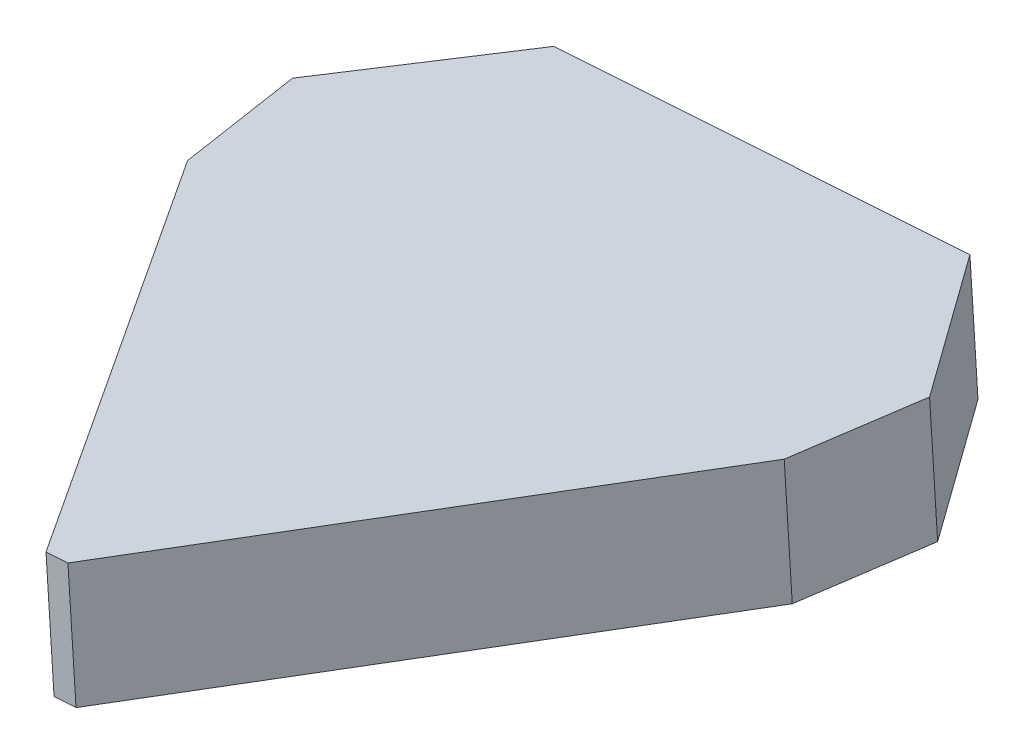
ISO-10303-21;
HEADER;
FILE_DESCRIPTION(('STEP AP214'),'2;1');
FILE_NAME('part.step','',(''),(''),'','','');
FILE_SCHEMA(('AUTOMOTIVE_DESIGN { 1 0 10303 214 1 1 1 1 }'));
ENDSEC;
DATA;
#1=APPLICATION_CONTEXT('core data for automotive mechanical design processes');
#2=APPLICATION_PROTOCOL_DEFINITION('international standard','automotive_design',2000,#1);
#3=PRODUCT_CONTEXT('',#1,'mechanical');
#4=PRODUCT('Part','Part','',(#3));
#5=PRODUCT_RELATED_PRODUCT_CATEGORY('part','',(#4));
#6=PRODUCT_DEFINITION_FORMATION('','',#4);
#7=PRODUCT_DEFINITION_CONTEXT('part definition',#1,'design');
#8=PRODUCT_DEFINITION('design','',#6,#7);
#9=PRODUCT_DEFINITION_SHAPE('','',#8);
#10=(LENGTH_UNIT() NAMED_UNIT(*) SI_UNIT(.MILLI.,.METRE.));
#11=(NAMED_UNIT(*) PLANE_ANGLE_UNIT() SI_UNIT($,.RADIAN.));
#12=(NAMED_UNIT(*) SI_UNIT($,.STERADIAN.) SOLID_ANGLE_UNIT());
#13=UNCERTAINTY_MEASURE_WITH_UNIT(LENGTH_MEASURE(1.E-05),#10,'distance_accuracy_value','');
#14=(GEOMETRIC_REPRESENTATION_CONTEXT(3) GLOBAL_UNCERTAINTY_ASSIGNED_CONTEXT((#13)) GLOBAL_UNIT_ASSIGNED_CONTEXT((#10,
#11,#12)) REPRESENTATION_CONTEXT('',''));
#15=CARTESIAN_POINT('',(0.,0.,0.));
#16=DIRECTION('',(0.,0.,1.));
#17=DIRECTION('',(1.,0.,0.));
#18=AXIS2_PLACEMENT_3D('',#15,#16,#17);
#19=CARTESIAN_POINT('',(66.04736781898,-49.9462567132194,133.429444574754));
#20=DIRECTION('',(0.,0.,1.));
#21=DIRECTION('',(1.,0.,0.));
#22=AXIS2_PLACEMENT_3D('',#19,#20,#21);
#23=PLANE('',#22);
#24=DIRECTION('',(-0.99779024737169,-0.0664426237436659,0.));
#25=VECTOR('',#24,1.);
#26=CARTESIAN_POINT('',(67.5755481650843,-72.8954324027683,133.429444574754));
#27=LINE('',#26,#25);
#28=CARTESIAN_POINT('',(67.5755481650843,-72.8954324027683,133.429444574754));
#29=VERTEX_POINT('',#28);
#30=CARTESIAN_POINT('',(63.4252354433026,-73.1718007750973,133.429444574754));
#31=VERTEX_POINT('',#30);
#32=EDGE_CURVE('E132',#29,#31,#27,.T.);
#33=ORIENTED_EDGE('',*,*,#32,.F.);
#34=DIRECTION('',(0.0664426237436648,-0.99779024737169,0.));
#35=VECTOR('',#34,1.);
#36=CARTESIAN_POINT('',(66.04736781898,-49.9462567132194,133.429444574754));
#37=LINE('',#36,#35);
#38=CARTESIAN_POINT('',(66.04736781898,-49.9462567132194,133.429444574754));
#39=VERTEX_POINT('',#38);
#40=EDGE_CURVE('E11',#39,#29,#37,.T.);
#41=ORIENTED_EDGE('',*,*,#40,.F.);
#42=DIRECTION('',(-0.99779024737169,-0.0664426237436659,0.));
#43=VECTOR('',#42,1.);
#44=CARTESIAN_POINT('',(66.04736781898,-49.9462567132194,133.429444574754));
#45=LINE('',#44,#43);
#46=CARTESIAN_POINT('',(61.8970550971983,-50.2226250855484,133.429444574754));
#47=VERTEX_POINT('',#46);
#48=EDGE_CURVE('E152',#39,#47,#45,.T.);
#49=ORIENTED_EDGE('',*,*,#48,.T.);
#50=DIRECTION('',(0.0664426237436648,-0.99779024737169,0.));
#51=VECTOR('',#50,1.);
#52=CARTESIAN_POINT('',(61.8970550971983,-50.2226250855484,133.429444574754));
#53=LINE('',#52,#51);
#54=EDGE_CURVE('E38',#47,#31,#53,.T.);
#55=ORIENTED_EDGE('',*,*,#54,.T.);
#56=EDGE_LOOP('',(#33,#41,#49,#55));
#57=FACE_BOUND('',#56,.T.);
#58=ADVANCED_FACE('F35',(#57),#23,.T.);
#59=CARTESIAN_POINT('',(120.442328114417,-46.3241087818466,52.2349737519865));
#60=DIRECTION('',(0.828390615980457,0.0551623411386873,0.557428115074597));
#61=DIRECTION('',(0.558278149998216,0.,-0.829653847839308));
#62=AXIS2_PLACEMENT_3D('',#59,#60,#61);
#63=PLANE('',#62);
#64=DIRECTION('',(-0.556196336832217,-0.0370369865140417,0.830225208316624));
#65=VECTOR('',#64,1.);
#66=CARTESIAN_POINT('',(121.970508460521,-69.2732844713955,52.2349737519865));
#67=LINE('',#66,#65);
#68=CARTESIAN_POINT('',(121.970508460521,-69.2732844713955,52.2349737519865));
#69=VERTEX_POINT('',#68);
#70=EDGE_CURVE('E150',#69,#29,#67,.T.);
#71=ORIENTED_EDGE('',*,*,#70,.F.);
#72=DIRECTION('',(0.0664426237436648,-0.99779024737169,0.));
#73=VECTOR('',#72,1.);
#74=CARTESIAN_POINT('',(120.442328114417,-46.3241087818466,52.2349737519865));
#75=LINE('',#74,#73);
#76=CARTESIAN_POINT('',(120.442328114417,-46.3241087818466,52.2349737519865));
#77=VERTEX_POINT('',#76);
#78=EDGE_CURVE('E44',#77,#69,#75,.T.);
#79=ORIENTED_EDGE('',*,*,#78,.F.);
#80=DIRECTION('',(-0.556196336832217,-0.0370369865140417,0.830225208316624));
#81=VECTOR('',#80,1.);
#82=CARTESIAN_POINT('',(120.442328114417,-46.3241087818466,52.2349737519865));
#83=LINE('',#82,#81);
#84=EDGE_CURVE('E122',#77,#39,#83,.T.);
#85=ORIENTED_EDGE('',*,*,#84,.T.);
#86=ORIENTED_EDGE('',*,*,#40,.T.);
#87=EDGE_LOOP('',(#71,#79,#85,#86));
#88=FACE_BOUND('',#87,.T.);
#89=ADVANCED_FACE('F164',(#88),#63,.T.);
#90=CARTESIAN_POINT('',(124.266391420117,-46.0694652833139,28.5429561822932));
#91=DIRECTION('',(0.984986002983277,0.0655899920463093,0.159688843913384));
#92=DIRECTION('',(0.160033450659154,0.,-0.987111591802124));
#93=AXIS2_PLACEMENT_3D('',#90,#91,#92);
#94=PLANE('',#93);
#95=DIRECTION('',(-0.159335971070835,-0.0106101457721976,0.987167398737219));
#96=VECTOR('',#95,1.);
#97=CARTESIAN_POINT('',(125.794571766221,-69.0186409728627,28.5429561822932));
#98=LINE('',#97,#96);
#99=CARTESIAN_POINT('',(125.794571766221,-69.0186409728627,28.5429561822932));
#100=VERTEX_POINT('',#99);
#101=EDGE_CURVE('E109',#100,#69,#98,.T.);
#102=ORIENTED_EDGE('',*,*,#101,.F.);
#103=DIRECTION('',(0.0664426237436648,-0.99779024737169,0.));
#104=VECTOR('',#103,1.);
#105=CARTESIAN_POINT('',(124.266391420117,-46.0694652833139,28.5429561822932));
#106=LINE('',#105,#104);
#107=CARTESIAN_POINT('',(124.266391420117,-46.0694652833139,28.5429561822932));
#108=VERTEX_POINT('',#107);
#109=EDGE_CURVE('E104',#108,#100,#106,.T.);
#110=ORIENTED_EDGE('',*,*,#109,.F.);
#111=DIRECTION('',(-0.159335971070835,-0.0106101457721976,0.987167398737219));
#112=VECTOR('',#111,1.);
#113=CARTESIAN_POINT('',(124.266391420117,-46.0694652833139,28.5429561822932));
#114=LINE('',#113,#112);
#115=EDGE_CURVE('E107',#108,#77,#114,.T.);
#116=ORIENTED_EDGE('',*,*,#115,.T.);
#117=ORIENTED_EDGE('',*,*,#78,.T.);
#118=EDGE_LOOP('',(#102,#110,#116,#117));
#119=FACE_BOUND('',#118,.T.);
#120=ADVANCED_FACE('F106',(#119),#94,.T.);
#121=CARTESIAN_POINT('',(103.364080691311,-47.4613453611013,0.));
#122=DIRECTION('',(0.804393156740389,0.0535643558313625,-0.591677707179849));
#123=DIRECTION('',(-0.592528341211539,0.,-0.805549604221305));
#124=AXIS2_PLACEMENT_3D('',#121,#122,#123);
#125=PLANE('',#124);
#126=DIRECTION('',(0.590370245811295,0.0393126192756651,0.806174603188662));
#127=VECTOR('',#126,1.);
#128=CARTESIAN_POINT('',(104.892261037415,-70.4105210506502,0.));
#129=LINE('',#128,#127);
#130=CARTESIAN_POINT('',(104.892261037415,-70.4105210506502,0.));
#131=VERTEX_POINT('',#130);
#132=EDGE_CURVE('E147',#131,#100,#129,.T.);
#133=ORIENTED_EDGE('',*,*,#132,.F.);
#134=DIRECTION('',(0.0664426237436648,-0.99779024737169,0.));
#135=VECTOR('',#134,1.);
#136=CARTESIAN_POINT('',(103.364080691311,-47.4613453611013,0.));
#137=LINE('',#136,#135);
#138=CARTESIAN_POINT('',(103.364080691311,-47.4613453611013,0.));
#139=VERTEX_POINT('',#138);
#140=EDGE_CURVE('E114',#139,#131,#137,.T.);
#141=ORIENTED_EDGE('',*,*,#140,.F.);
#142=DIRECTION('',(0.590370245811295,0.0393126192756651,0.806174603188662));
#143=VECTOR('',#142,1.);
#144=CARTESIAN_POINT('',(103.364080691311,-47.4613453611013,0.));
#145=LINE('',#144,#143);
#146=EDGE_CURVE('E120',#139,#108,#145,.T.);
#147=ORIENTED_EDGE('',*,*,#146,.T.);
#148=ORIENTED_EDGE('',*,*,#109,.T.);
#149=EDGE_LOOP('',(#133,#141,#147,#148));
#150=FACE_BOUND('',#149,.T.);
#151=ADVANCED_FACE('F124',(#150),#125,.T.);
#152=CARTESIAN_POINT('',(24.5803422248675,-52.7075364376665,0.));
#153=DIRECTION('',(0.,0.,-1.));
#154=DIRECTION('',(0.,1.,0.));
#155=AXIS2_PLACEMENT_3D('',#152,#153,#154);
#156=PLANE('',#155);
#157=DIRECTION('',(0.99779024737169,0.0664426237436648,0.));
#158=VECTOR('',#157,1.);
#159=CARTESIAN_POINT('',(26.1085225709718,-75.6567121272154,0.));
#160=LINE('',#159,#158);
#161=CARTESIAN_POINT('',(26.1085225709718,-75.6567121272154,0.));
#162=VERTEX_POINT('',#161);
#163=EDGE_CURVE('E144',#162,#131,#160,.T.);
#164=ORIENTED_EDGE('',*,*,#163,.F.);
#165=DIRECTION('',(0.0664426237436648,-0.99779024737169,0.));
#166=VECTOR('',#165,1.);
#167=CARTESIAN_POINT('',(24.5803422248675,-52.7075364376665,0.));
#168=LINE('',#167,#166);
#169=CARTESIAN_POINT('',(24.5803422248675,-52.7075364376665,0.));
#170=VERTEX_POINT('',#169);
#171=EDGE_CURVE('E156',#170,#162,#168,.T.);
#172=ORIENTED_EDGE('',*,*,#171,.F.);
#173=DIRECTION('',(0.99779024737169,0.0664426237436648,0.));
#174=VECTOR('',#173,1.);
#175=CARTESIAN_POINT('',(24.5803422248675,-52.7075364376665,0.));
#176=LINE('',#175,#174);
#177=EDGE_CURVE('E125',#170,#139,#176,.T.);
#178=ORIENTED_EDGE('',*,*,#177,.T.);
#179=ORIENTED_EDGE('',*,*,#140,.T.);
#180=EDGE_LOOP('',(#164,#172,#178,#179));
#181=FACE_BOUND('',#180,.T.);
#182=ADVANCED_FACE('F177',(#181),#156,.T.);
#183=CARTESIAN_POINT('',(3.67803149606129,-54.099416515454,28.5429561822932));
#184=DIRECTION('',(-0.804393156740389,-0.0535643558313626,-0.591677707179849));
#185=DIRECTION('',(-0.59252834121154,0.,0.805549604221305));
#186=AXIS2_PLACEMENT_3D('',#183,#184,#185);
#187=PLANE('',#186);
#188=DIRECTION('',(0.590370245811296,0.0393126192756651,-0.806174603188662));
#189=VECTOR('',#188,1.);
#190=CARTESIAN_POINT('',(5.20621184216558,-77.0485922050028,28.5429561822932));
#191=LINE('',#190,#189);
#192=CARTESIAN_POINT('',(5.20621184216558,-77.0485922050028,28.5429561822932));
#193=VERTEX_POINT('',#192);
#194=EDGE_CURVE('E141',#193,#162,#191,.T.);
#195=ORIENTED_EDGE('',*,*,#194,.F.);
#196=DIRECTION('',(0.0664426237436648,-0.99779024737169,0.));
#197=VECTOR('',#196,1.);
#198=CARTESIAN_POINT('',(3.67803149606129,-54.099416515454,28.5429561822932));
#199=LINE('',#198,#197);
#200=CARTESIAN_POINT('',(3.67803149606129,-54.099416515454,28.5429561822932));
#201=VERTEX_POINT('',#200);
#202=EDGE_CURVE('E158',#201,#193,#199,.T.);
#203=ORIENTED_EDGE('',*,*,#202,.F.);
#204=DIRECTION('',(0.590370245811296,0.0393126192756651,-0.806174603188662));
#205=VECTOR('',#204,1.);
#206=CARTESIAN_POINT('',(3.67803149606129,-54.099416515454,28.5429561822932));
#207=LINE('',#206,#205);
#208=EDGE_CURVE('E127',#201,#170,#207,.T.);
#209=ORIENTED_EDGE('',*,*,#208,.T.);
#210=ORIENTED_EDGE('',*,*,#171,.T.);
#211=EDGE_LOOP('',(#195,#203,#209,#210));
#212=FACE_BOUND('',#211,.T.);
#213=ADVANCED_FACE('F180',(#212),#187,.T.);
#214=CARTESIAN_POINT('',(7.50209480176133,-53.8447730169212,52.2349737519865));
#215=DIRECTION('',(-0.984986002983277,-0.0655899920463093,0.159688843913385));
#216=DIRECTION('',(0.160033450659154,0.,0.987111591802124));
#217=AXIS2_PLACEMENT_3D('',#214,#215,#216);
#218=PLANE('',#217);
#219=DIRECTION('',(-0.159335971070835,-0.0106101457721982,-0.987167398737219));
#220=VECTOR('',#219,1.);
#221=CARTESIAN_POINT('',(9.03027514786562,-76.7939487064701,52.2349737519865));
#222=LINE('',#221,#220);
#223=CARTESIAN_POINT('',(9.03027514786562,-76.7939487064701,52.2349737519865));
#224=VERTEX_POINT('',#223);
#225=EDGE_CURVE('E138',#224,#193,#222,.T.);
#226=ORIENTED_EDGE('',*,*,#225,.F.);
#227=DIRECTION('',(0.0664426237436648,-0.99779024737169,0.));
#228=VECTOR('',#227,1.);
#229=CARTESIAN_POINT('',(7.50209480176133,-53.8447730169212,52.2349737519865));
#230=LINE('',#229,#228);
#231=CARTESIAN_POINT('',(7.50209480176133,-53.8447730169212,52.2349737519865));
#232=VERTEX_POINT('',#231);
#233=EDGE_CURVE('E159',#232,#224,#230,.T.);
#234=ORIENTED_EDGE('',*,*,#233,.F.);
#235=DIRECTION('',(-0.159335971070835,-0.0106101457721982,-0.987167398737219));
#236=VECTOR('',#235,1.);
#237=CARTESIAN_POINT('',(7.50209480176133,-53.8447730169212,52.2349737519865));
#238=LINE('',#237,#236);
#239=EDGE_CURVE('E255',#232,#201,#238,.T.);
#240=ORIENTED_EDGE('',*,*,#239,.T.);
#241=ORIENTED_EDGE('',*,*,#202,.T.);
#242=EDGE_LOOP('',(#226,#234,#240,#241));
#243=FACE_BOUND('',#242,.T.);
#244=ADVANCED_FACE('F184',(#243),#218,.T.);
#245=CARTESIAN_POINT('',(61.8970550971983,-50.2226250855484,133.429444574754));
#246=DIRECTION('',(-0.828390615980457,-0.0551623411386871,0.557428115074597));
#247=DIRECTION('',(0.558278149998216,0.,0.829653847839308));
#248=AXIS2_PLACEMENT_3D('',#245,#246,#247);
#249=PLANE('',#248);
#250=DIRECTION('',(-0.556196336832217,-0.0370369865140418,-0.830225208316624));
#251=VECTOR('',#250,1.);
#252=CARTESIAN_POINT('',(63.4252354433026,-73.1718007750973,133.429444574754));
#253=LINE('',#252,#251);
#254=EDGE_CURVE('E135',#31,#224,#253,.T.);
#255=ORIENTED_EDGE('',*,*,#254,.F.);
#256=ORIENTED_EDGE('',*,*,#54,.F.);
#257=DIRECTION('',(-0.556196336832217,-0.0370369865140418,-0.830225208316624));
#258=VECTOR('',#257,1.);
#259=CARTESIAN_POINT('',(61.8970550971983,-50.2226250855484,133.429444574754));
#260=LINE('',#259,#258);
#261=EDGE_CURVE('E256',#47,#232,#260,.T.);
#262=ORIENTED_EDGE('',*,*,#261,.T.);
#263=ORIENTED_EDGE('',*,*,#233,.T.);
#264=EDGE_LOOP('',(#255,#256,#262,#263));
#265=FACE_BOUND('',#264,.T.);
#266=ADVANCED_FACE('F161',(#265),#249,.T.);
#267=CARTESIAN_POINT('',(3.60280132428641,-54.1044260753395,0.));
#268=DIRECTION('',(0.0664426237436659,-0.99779024737169,0.));
#269=DIRECTION('',(0.99779024737169,0.0664426237436659,0.));
#270=AXIS2_PLACEMENT_3D('',#267,#268,#269);
#271=PLANE('',#270);
#272=ORIENTED_EDGE('',*,*,#48,.F.);
#273=ORIENTED_EDGE('',*,*,#84,.F.);
#274=ORIENTED_EDGE('',*,*,#115,.F.);
#275=ORIENTED_EDGE('',*,*,#146,.F.);
#276=ORIENTED_EDGE('',*,*,#177,.F.);
#277=ORIENTED_EDGE('',*,*,#208,.F.);
#278=ORIENTED_EDGE('',*,*,#239,.F.);
#279=ORIENTED_EDGE('',*,*,#261,.F.);
#280=EDGE_LOOP('',(#272,#273,#274,#275,#276,#277,#278,#279));
#281=FACE_BOUND('',#280,.T.);
#282=ADVANCED_FACE('F118',(#281),#271,.F.);
#283=CARTESIAN_POINT('',(5.1309816703907,-77.0536017648884,0.));
#284=DIRECTION('',(0.0664426237436659,-0.99779024737169,0.));
#285=DIRECTION('',(0.99779024737169,0.0664426237436659,0.));
#286=AXIS2_PLACEMENT_3D('',#283,#284,#285);
#287=PLANE('',#286);
#288=ORIENTED_EDGE('',*,*,#32,.T.);
#289=ORIENTED_EDGE('',*,*,#254,.T.);
#290=ORIENTED_EDGE('',*,*,#225,.T.);
#291=ORIENTED_EDGE('',*,*,#194,.T.);
#292=ORIENTED_EDGE('',*,*,#163,.T.);
#293=ORIENTED_EDGE('',*,*,#132,.T.);
#294=ORIENTED_EDGE('',*,*,#101,.T.);
#295=ORIENTED_EDGE('',*,*,#70,.T.);
#296=EDGE_LOOP('',(#288,#289,#290,#291,#292,#293,#294,#295));
#297=FACE_BOUND('',#296,.T.);
#298=ADVANCED_FACE('F163',(#297),#287,.T.);
#299=CLOSED_SHELL('',(#58,#89,#120,#151,#182,#213,#244,#266,#282,#298));
#300=MANIFOLD_SOLID_BREP('B2',#299);
#301=ADVANCED_BREP_SHAPE_REPRESENTATION('',(#18,#300),#14);
#302=SHAPE_DEFINITION_REPRESENTATION(#9,#301);
ENDSEC;
END-ISO-10303-21;
